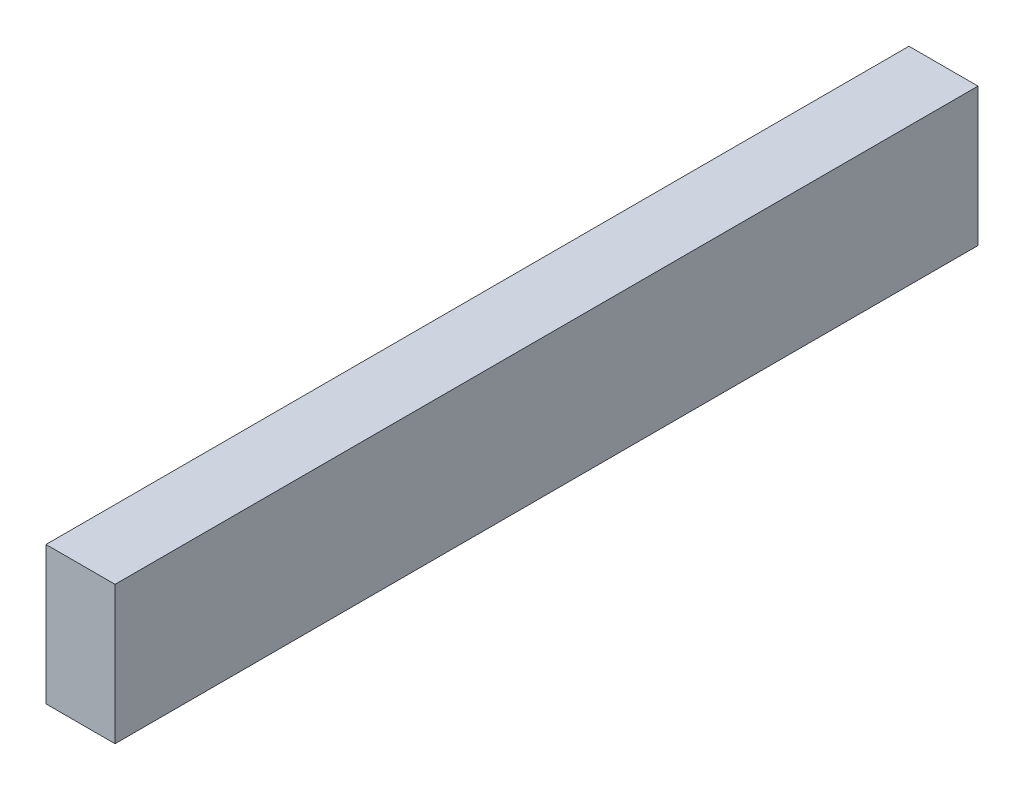
ISO-10303-21;
HEADER;
FILE_DESCRIPTION(('STEP AP214'),'2;1');
FILE_NAME('part.step','',(''),(''),'','','');
FILE_SCHEMA(('AUTOMOTIVE_DESIGN { 1 0 10303 214 1 1 1 1 }'));
ENDSEC;
DATA;
#1=APPLICATION_CONTEXT('core data for automotive mechanical design processes');
#2=APPLICATION_PROTOCOL_DEFINITION('international standard','automotive_design',2000,#1);
#3=PRODUCT_CONTEXT('',#1,'mechanical');
#4=PRODUCT('Part','Part','',(#3));
#5=PRODUCT_RELATED_PRODUCT_CATEGORY('part','',(#4));
#6=PRODUCT_DEFINITION_FORMATION('','',#4);
#7=PRODUCT_DEFINITION_CONTEXT('part definition',#1,'design');
#8=PRODUCT_DEFINITION('design','',#6,#7);
#9=PRODUCT_DEFINITION_SHAPE('','',#8);
#10=(LENGTH_UNIT() NAMED_UNIT(*) SI_UNIT(.MILLI.,.METRE.));
#11=(NAMED_UNIT(*) PLANE_ANGLE_UNIT() SI_UNIT($,.RADIAN.));
#12=(NAMED_UNIT(*) SI_UNIT($,.STERADIAN.) SOLID_ANGLE_UNIT());
#13=UNCERTAINTY_MEASURE_WITH_UNIT(LENGTH_MEASURE(1.E-05),#10,'distance_accuracy_value','');
#14=(GEOMETRIC_REPRESENTATION_CONTEXT(3) GLOBAL_UNCERTAINTY_ASSIGNED_CONTEXT((#13)) GLOBAL_UNIT_ASSIGNED_CONTEXT((#10,
#11,#12)) REPRESENTATION_CONTEXT('',''));
#15=CARTESIAN_POINT('',(0.,0.,0.));
#16=DIRECTION('',(0.,0.,1.));
#17=DIRECTION('',(1.,0.,0.));
#18=AXIS2_PLACEMENT_3D('',#15,#16,#17);
#19=CARTESIAN_POINT('',(152.,-32.3,692.64406037513));
#20=DIRECTION('',(0.,0.,-1.));
#21=DIRECTION('',(-1.,0.,0.));
#22=AXIS2_PLACEMENT_3D('',#19,#20,#21);
#23=PLANE('',#22);
#24=DIRECTION('',(0.,-1.,0.));
#25=VECTOR('',#24,1.);
#26=CARTESIAN_POINT('',(0.,-32.3,692.64406037513));
#27=LINE('',#26,#25);
#28=CARTESIAN_POINT('',(0.,271.7,692.64406037513));
#29=VERTEX_POINT('',#28);
#30=CARTESIAN_POINT('',(0.,-32.3,692.64406037513));
#31=VERTEX_POINT('',#30);
#32=EDGE_CURVE('E106',#29,#31,#27,.T.);
#33=ORIENTED_EDGE('',*,*,#32,.T.);
#34=DIRECTION('',(-1.,0.,0.));
#35=VECTOR('',#34,1.);
#36=CARTESIAN_POINT('',(152.,-32.3,692.64406037513));
#37=LINE('',#36,#35);
#38=CARTESIAN_POINT('',(152.,-32.3,692.64406037513));
#39=VERTEX_POINT('',#38);
#40=EDGE_CURVE('E12',#39,#31,#37,.T.);
#41=ORIENTED_EDGE('',*,*,#40,.F.);
#42=DIRECTION('',(0.,-1.,0.));
#43=VECTOR('',#42,1.);
#44=CARTESIAN_POINT('',(152.,-32.3,692.64406037513));
#45=LINE('',#44,#43);
#46=CARTESIAN_POINT('',(152.,271.7,692.64406037513));
#47=VERTEX_POINT('',#46);
#48=EDGE_CURVE('E94',#47,#39,#45,.T.);
#49=ORIENTED_EDGE('',*,*,#48,.F.);
#50=DIRECTION('',(-1.,0.,0.));
#51=VECTOR('',#50,1.);
#52=CARTESIAN_POINT('',(152.,271.7,692.64406037513));
#53=LINE('',#52,#51);
#54=EDGE_CURVE('E102',#47,#29,#53,.T.);
#55=ORIENTED_EDGE('',*,*,#54,.T.);
#56=EDGE_LOOP('',(#33,#41,#49,#55));
#57=FACE_BOUND('',#56,.T.);
#58=ADVANCED_FACE('F43',(#57),#23,.F.);
#59=CARTESIAN_POINT('',(152.,-32.3,692.64406037513));
#60=DIRECTION('',(0.,1.,0.));
#61=DIRECTION('',(0.,0.,1.));
#62=AXIS2_PLACEMENT_3D('',#59,#60,#61);
#63=PLANE('',#62);
#64=DIRECTION('',(0.,0.,-1.));
#65=VECTOR('',#64,1.);
#66=CARTESIAN_POINT('',(0.,-32.3,692.64406037513));
#67=LINE('',#66,#65);
#68=CARTESIAN_POINT('',(0.,-32.3,-1207.35593962487));
#69=VERTEX_POINT('',#68);
#70=EDGE_CURVE('E98',#31,#69,#67,.T.);
#71=ORIENTED_EDGE('',*,*,#70,.T.);
#72=DIRECTION('',(-1.,0.,0.));
#73=VECTOR('',#72,1.);
#74=CARTESIAN_POINT('',(152.,-32.3,-1207.35593962487));
#75=LINE('',#74,#73);
#76=CARTESIAN_POINT('',(152.,-32.3,-1207.35593962487));
#77=VERTEX_POINT('',#76);
#78=EDGE_CURVE('E51',#77,#69,#75,.T.);
#79=ORIENTED_EDGE('',*,*,#78,.F.);
#80=DIRECTION('',(0.,0.,-1.));
#81=VECTOR('',#80,1.);
#82=CARTESIAN_POINT('',(152.,-32.3,692.64406037513));
#83=LINE('',#82,#81);
#84=EDGE_CURVE('E89',#39,#77,#83,.T.);
#85=ORIENTED_EDGE('',*,*,#84,.F.);
#86=ORIENTED_EDGE('',*,*,#40,.T.);
#87=EDGE_LOOP('',(#71,#79,#85,#86));
#88=FACE_BOUND('',#87,.T.);
#89=ADVANCED_FACE('F97',(#88),#63,.F.);
#90=CARTESIAN_POINT('',(152.,-32.3,-1207.35593962487));
#91=DIRECTION('',(0.,0.,1.));
#92=DIRECTION('',(1.,0.,0.));
#93=AXIS2_PLACEMENT_3D('',#90,#91,#92);
#94=PLANE('',#93);
#95=DIRECTION('',(0.,1.,0.));
#96=VECTOR('',#95,1.);
#97=CARTESIAN_POINT('',(0.,-32.3,-1207.35593962487));
#98=LINE('',#97,#96);
#99=CARTESIAN_POINT('',(0.,271.7,-1207.35593962487));
#100=VERTEX_POINT('',#99);
#101=EDGE_CURVE('E76',#69,#100,#98,.T.);
#102=ORIENTED_EDGE('',*,*,#101,.T.);
#103=DIRECTION('',(-1.,0.,0.));
#104=VECTOR('',#103,1.);
#105=CARTESIAN_POINT('',(152.,271.7,-1207.35593962487));
#106=LINE('',#105,#104);
#107=CARTESIAN_POINT('',(152.,271.7,-1207.35593962487));
#108=VERTEX_POINT('',#107);
#109=EDGE_CURVE('E99',#108,#100,#106,.T.);
#110=ORIENTED_EDGE('',*,*,#109,.F.);
#111=DIRECTION('',(0.,1.,0.));
#112=VECTOR('',#111,1.);
#113=CARTESIAN_POINT('',(152.,-32.3,-1207.35593962487));
#114=LINE('',#113,#112);
#115=EDGE_CURVE('E92',#77,#108,#114,.T.);
#116=ORIENTED_EDGE('',*,*,#115,.F.);
#117=ORIENTED_EDGE('',*,*,#78,.T.);
#118=EDGE_LOOP('',(#102,#110,#116,#117));
#119=FACE_BOUND('',#118,.T.);
#120=ADVANCED_FACE('F100',(#119),#94,.F.);
#121=CARTESIAN_POINT('',(152.,271.7,692.64406037513));
#122=DIRECTION('',(0.,-1.,0.));
#123=DIRECTION('',(0.,0.,-1.));
#124=AXIS2_PLACEMENT_3D('',#121,#122,#123);
#125=PLANE('',#124);
#126=DIRECTION('',(0.,0.,1.));
#127=VECTOR('',#126,1.);
#128=CARTESIAN_POINT('',(0.,271.7,692.64406037513));
#129=LINE('',#128,#127);
#130=EDGE_CURVE('E82',#100,#29,#129,.T.);
#131=ORIENTED_EDGE('',*,*,#130,.T.);
#132=ORIENTED_EDGE('',*,*,#54,.F.);
#133=DIRECTION('',(0.,0.,1.));
#134=VECTOR('',#133,1.);
#135=CARTESIAN_POINT('',(152.,271.7,692.64406037513));
#136=LINE('',#135,#134);
#137=EDGE_CURVE('E59',#108,#47,#136,.T.);
#138=ORIENTED_EDGE('',*,*,#137,.F.);
#139=ORIENTED_EDGE('',*,*,#109,.T.);
#140=EDGE_LOOP('',(#131,#132,#138,#139));
#141=FACE_BOUND('',#140,.T.);
#142=ADVANCED_FACE('F113',(#141),#125,.F.);
#143=CARTESIAN_POINT('',(152.,0.,0.));
#144=DIRECTION('',(-1.,0.,0.));
#145=DIRECTION('',(0.,0.,1.));
#146=AXIS2_PLACEMENT_3D('',#143,#144,#145);
#147=PLANE('',#146);
#148=ORIENTED_EDGE('',*,*,#48,.T.);
#149=ORIENTED_EDGE('',*,*,#84,.T.);
#150=ORIENTED_EDGE('',*,*,#115,.T.);
#151=ORIENTED_EDGE('',*,*,#137,.T.);
#152=EDGE_LOOP('',(#148,#149,#150,#151));
#153=FACE_BOUND('',#152,.T.);
#154=ADVANCED_FACE('F90',(#153),#147,.F.);
#155=CARTESIAN_POINT('',(0.,0.,0.));
#156=DIRECTION('',(-1.,0.,0.));
#157=DIRECTION('',(0.,0.,1.));
#158=AXIS2_PLACEMENT_3D('',#155,#156,#157);
#159=PLANE('',#158);
#160=ORIENTED_EDGE('',*,*,#32,.F.);
#161=ORIENTED_EDGE('',*,*,#130,.F.);
#162=ORIENTED_EDGE('',*,*,#101,.F.);
#163=ORIENTED_EDGE('',*,*,#70,.F.);
#164=EDGE_LOOP('',(#160,#161,#162,#163));
#165=FACE_BOUND('',#164,.T.);
#166=ADVANCED_FACE('F116',(#165),#159,.T.);
#167=CLOSED_SHELL('',(#58,#89,#120,#142,#154,#166));
#168=MANIFOLD_SOLID_BREP('B2',#167);
#169=CARTESIAN_POINT('',(69.,0.,0.));
#170=DIRECTION('',(0.,1.,0.));
#171=DIRECTION('',(0.,0.,1.));
#172=AXIS2_PLACEMENT_3D('',#169,#170,#171);
#173=PLANE('',#172);
#174=DIRECTION('',(-1.,0.,0.));
#175=VECTOR('',#174,1.);
#176=CARTESIAN_POINT('',(-48.6,0.,-92.6559396248703));
#177=LINE('',#176,#175);
#178=CARTESIAN_POINT('',(-48.6,0.,-92.6559396248703));
#179=VERTEX_POINT('',#178);
#180=CARTESIAN_POINT('',(-69.,0.,-92.6559396248703));
#181=VERTEX_POINT('',#180);
#182=EDGE_CURVE('E356',#179,#181,#177,.T.);
#183=ORIENTED_EDGE('',*,*,#182,.T.);
#184=DIRECTION('',(0.,0.,-1.));
#185=VECTOR('',#184,1.);
#186=CARTESIAN_POINT('',(-69.,0.,0.));
#187=LINE('',#186,#185);
#188=CARTESIAN_POINT('',(-69.,0.,-165.1));
#189=VERTEX_POINT('',#188);
#190=EDGE_CURVE('E340',#181,#189,#187,.T.);
#191=ORIENTED_EDGE('',*,*,#190,.T.);
#192=DIRECTION('',(-1.,0.,0.));
#193=VECTOR('',#192,1.);
#194=CARTESIAN_POINT('',(69.,0.,-165.1));
#195=LINE('',#194,#193);
#196=CARTESIAN_POINT('',(69.,0.,-165.1));
#197=VERTEX_POINT('',#196);
#198=EDGE_CURVE('E491',#197,#189,#195,.T.);
#199=ORIENTED_EDGE('',*,*,#198,.F.);
#200=DIRECTION('',(0.,0.,-1.));
#201=VECTOR('',#200,1.);
#202=CARTESIAN_POINT('',(69.,0.,262.79362659682));
#203=LINE('',#202,#201);
#204=CARTESIAN_POINT('',(69.,0.,-92.6559396248703));
#205=VERTEX_POINT('',#204);
#206=EDGE_CURVE('E440',#205,#197,#203,.T.);
#207=ORIENTED_EDGE('',*,*,#206,.F.);
#208=DIRECTION('',(1.,0.,0.));
#209=VECTOR('',#208,1.);
#210=CARTESIAN_POINT('',(48.6,0.,-92.6559396248703));
#211=LINE('',#210,#209);
#212=CARTESIAN_POINT('',(48.6,0.,-92.6559396248703));
#213=VERTEX_POINT('',#212);
#214=EDGE_CURVE('E393',#213,#205,#211,.T.);
#215=ORIENTED_EDGE('',*,*,#214,.F.);
#216=DIRECTION('',(0.,0.,1.));
#217=VECTOR('',#216,1.);
#218=CARTESIAN_POINT('',(48.6,0.,-28.0559396248703));
#219=LINE('',#218,#217);
#220=CARTESIAN_POINT('',(48.6,0.,-28.0559396248703));
#221=VERTEX_POINT('',#220);
#222=EDGE_CURVE('E390',#213,#221,#219,.T.);
#223=ORIENTED_EDGE('',*,*,#222,.T.);
#224=DIRECTION('',(1.,0.,0.));
#225=VECTOR('',#224,1.);
#226=CARTESIAN_POINT('',(48.6,0.,-28.0559396248703));
#227=LINE('',#226,#225);
#228=CARTESIAN_POINT('',(69.,0.,-28.0559396248703));
#229=VERTEX_POINT('',#228);
#230=EDGE_CURVE('E395',#221,#229,#227,.T.);
#231=ORIENTED_EDGE('',*,*,#230,.T.);
#232=CARTESIAN_POINT('',(69.,0.,160.34406037513));
#233=VERTEX_POINT('',#232);
#234=EDGE_CURVE('E446',#233,#229,#203,.T.);
#235=ORIENTED_EDGE('',*,*,#234,.F.);
#236=DIRECTION('',(1.,0.,0.));
#237=VECTOR('',#236,1.);
#238=CARTESIAN_POINT('',(48.6,0.,160.34406037513));
#239=LINE('',#238,#237);
#240=CARTESIAN_POINT('',(48.6,0.,160.34406037513));
#241=VERTEX_POINT('',#240);
#242=EDGE_CURVE('E406',#241,#233,#239,.T.);
#243=ORIENTED_EDGE('',*,*,#242,.F.);
#244=DIRECTION('',(0.,0.,1.));
#245=VECTOR('',#244,1.);
#246=CARTESIAN_POINT('',(48.6,0.,224.94406037513));
#247=LINE('',#246,#245);
#248=CARTESIAN_POINT('',(48.6,0.,224.94406037513));
#249=VERTEX_POINT('',#248);
#250=EDGE_CURVE('E403',#241,#249,#247,.T.);
#251=ORIENTED_EDGE('',*,*,#250,.T.);
#252=DIRECTION('',(1.,0.,0.));
#253=VECTOR('',#252,1.);
#254=CARTESIAN_POINT('',(48.6,0.,224.94406037513));
#255=LINE('',#254,#253);
#256=CARTESIAN_POINT('',(69.,0.,224.94406037513));
#257=VERTEX_POINT('',#256);
#258=EDGE_CURVE('E408',#249,#257,#255,.T.);
#259=ORIENTED_EDGE('',*,*,#258,.T.);
#260=CARTESIAN_POINT('',(69.,0.,262.79362659682));
#261=VERTEX_POINT('',#260);
#262=EDGE_CURVE('E442',#261,#257,#203,.T.);
#263=ORIENTED_EDGE('',*,*,#262,.F.);
#264=DIRECTION('',(-1.,0.,0.));
#265=VECTOR('',#264,1.);
#266=CARTESIAN_POINT('',(69.,0.,262.79362659682));
#267=LINE('',#266,#265);
#268=CARTESIAN_POINT('',(-69.,0.,262.79362659682));
#269=VERTEX_POINT('',#268);
#270=EDGE_CURVE('E493',#261,#269,#267,.T.);
#271=ORIENTED_EDGE('',*,*,#270,.T.);
#272=CARTESIAN_POINT('',(-69.,0.,224.94406037513));
#273=VERTEX_POINT('',#272);
#274=EDGE_CURVE('E354',#269,#273,#187,.T.);
#275=ORIENTED_EDGE('',*,*,#274,.T.);
#276=DIRECTION('',(-1.,0.,0.));
#277=VECTOR('',#276,1.);
#278=CARTESIAN_POINT('',(-48.6,0.,224.94406037513));
#279=LINE('',#278,#277);
#280=CARTESIAN_POINT('',(-48.6,0.,224.94406037513));
#281=VERTEX_POINT('',#280);
#282=EDGE_CURVE('E379',#281,#273,#279,.T.);
#283=ORIENTED_EDGE('',*,*,#282,.F.);
#284=DIRECTION('',(0.,0.,1.));
#285=VECTOR('',#284,1.);
#286=CARTESIAN_POINT('',(-48.6,0.,224.94406037513));
#287=LINE('',#286,#285);
#288=CARTESIAN_POINT('',(-48.6,0.,160.34406037513));
#289=VERTEX_POINT('',#288);
#290=EDGE_CURVE('E376',#289,#281,#287,.T.);
#291=ORIENTED_EDGE('',*,*,#290,.F.);
#292=DIRECTION('',(-1.,0.,0.));
#293=VECTOR('',#292,1.);
#294=CARTESIAN_POINT('',(-48.6,0.,160.34406037513));
#295=LINE('',#294,#293);
#296=CARTESIAN_POINT('',(-69.,0.,160.34406037513));
#297=VERTEX_POINT('',#296);
#298=EDGE_CURVE('E382',#289,#297,#295,.T.);
#299=ORIENTED_EDGE('',*,*,#298,.T.);
#300=CARTESIAN_POINT('',(-69.,0.,-28.0559396248702));
#301=VERTEX_POINT('',#300);
#302=EDGE_CURVE('E351',#297,#301,#187,.T.);
#303=ORIENTED_EDGE('',*,*,#302,.T.);
#304=DIRECTION('',(-1.,0.,0.));
#305=VECTOR('',#304,1.);
#306=CARTESIAN_POINT('',(-48.6,0.,-28.0559396248703));
#307=LINE('',#306,#305);
#308=CARTESIAN_POINT('',(-48.6,0.,-28.0559396248703));
#309=VERTEX_POINT('',#308);
#310=EDGE_CURVE('E363',#309,#301,#307,.T.);
#311=ORIENTED_EDGE('',*,*,#310,.F.);
#312=DIRECTION('',(0.,0.,1.));
#313=VECTOR('',#312,1.);
#314=CARTESIAN_POINT('',(-48.6,0.,-28.0559396248703));
#315=LINE('',#314,#313);
#316=EDGE_CURVE('E358',#179,#309,#315,.T.);
#317=ORIENTED_EDGE('',*,*,#316,.F.);
#318=EDGE_LOOP('',(#183,#191,#199,#207,#215,#223,#231,#235,#243,#251,#259,#263,#271,#275,#283,
#291,#299,#303,#311,#317));
#319=FACE_BOUND('',#318,.T.);
#320=ADVANCED_FACE('F167',(#319),#173,.F.);
#321=CARTESIAN_POINT('',(69.,81.9,-150.1));
#322=DIRECTION('',(0.,0.,-1.));
#323=DIRECTION('',(-1.,0.,0.));
#324=AXIS2_PLACEMENT_3D('',#321,#322,#323);
#325=PLANE('',#324);
#326=DIRECTION('',(-1.,0.,0.));
#327=VECTOR('',#326,1.);
#328=CARTESIAN_POINT('',(69.,81.9,-150.1));
#329=LINE('',#328,#327);
#330=CARTESIAN_POINT('',(54.,81.9,-150.1));
#331=VERTEX_POINT('',#330);
#332=CARTESIAN_POINT('',(-54.,81.9,-150.1));
#333=VERTEX_POINT('',#332);
#334=EDGE_CURVE('E486',#331,#333,#329,.T.);
#335=ORIENTED_EDGE('',*,*,#334,.T.);
#336=DIRECTION('',(0.,-1.,0.));
#337=VECTOR('',#336,1.);
#338=CARTESIAN_POINT('',(-54.,232.747638364013,-150.1));
#339=LINE('',#338,#337);
#340=CARTESIAN_POINT('',(-54.,20.,-150.1));
#341=VERTEX_POINT('',#340);
#342=EDGE_CURVE('E423',#333,#341,#339,.T.);
#343=ORIENTED_EDGE('',*,*,#342,.T.);
#344=DIRECTION('',(-1.,0.,0.));
#345=VECTOR('',#344,1.);
#346=CARTESIAN_POINT('',(69.,20.,-150.1));
#347=LINE('',#346,#345);
#348=CARTESIAN_POINT('',(54.,20.,-150.1));
#349=VERTEX_POINT('',#348);
#350=EDGE_CURVE('E483',#349,#341,#347,.T.);
#351=ORIENTED_EDGE('',*,*,#350,.F.);
#352=DIRECTION('',(0.,-1.,0.));
#353=VECTOR('',#352,1.);
#354=CARTESIAN_POINT('',(54.,232.747638364013,-150.1));
#355=LINE('',#354,#353);
#356=EDGE_CURVE('E434',#331,#349,#355,.T.);
#357=ORIENTED_EDGE('',*,*,#356,.F.);
#358=EDGE_LOOP('',(#335,#343,#351,#357));
#359=FACE_BOUND('',#358,.T.);
#360=ADVANCED_FACE('F608',(#359),#325,.F.);
#361=CARTESIAN_POINT('',(69.,20.,-150.1));
#362=DIRECTION('',(0.,-1.,0.));
#363=DIRECTION('',(0.,0.,-1.));
#364=AXIS2_PLACEMENT_3D('',#361,#362,#363);
#365=PLANE('',#364);
#366=ORIENTED_EDGE('',*,*,#350,.T.);
#367=DIRECTION('',(0.,0.,1.));
#368=VECTOR('',#367,1.);
#369=CARTESIAN_POINT('',(-54.,20.,0.));
#370=LINE('',#369,#368);
#371=CARTESIAN_POINT('',(-54.,20.,0.));
#372=VERTEX_POINT('',#371);
#373=EDGE_CURVE('E411',#341,#372,#370,.T.);
#374=ORIENTED_EDGE('',*,*,#373,.T.);
#375=DIRECTION('',(-1.,0.,0.));
#376=VECTOR('',#375,1.);
#377=CARTESIAN_POINT('',(69.,20.,0.));
#378=LINE('',#377,#376);
#379=CARTESIAN_POINT('',(54.,20.,0.));
#380=VERTEX_POINT('',#379);
#381=EDGE_CURVE('E463',#380,#372,#378,.T.);
#382=ORIENTED_EDGE('',*,*,#381,.F.);
#383=DIRECTION('',(0.,0.,1.));
#384=VECTOR('',#383,1.);
#385=CARTESIAN_POINT('',(54.,20.,0.));
#386=LINE('',#385,#384);
#387=EDGE_CURVE('E421',#349,#380,#386,.T.);
#388=ORIENTED_EDGE('',*,*,#387,.F.);
#389=EDGE_LOOP('',(#366,#374,#382,#388));
#390=FACE_BOUND('',#389,.T.);
#391=ADVANCED_FACE('F613',(#390),#365,.F.);
#392=CARTESIAN_POINT('',(69.,20.,0.));
#393=DIRECTION('',(0.,0.,1.));
#394=DIRECTION('',(1.,0.,0.));
#395=AXIS2_PLACEMENT_3D('',#392,#393,#394);
#396=PLANE('',#395);
#397=DIRECTION('',(0.,1.,0.));
#398=VECTOR('',#397,1.);
#399=CARTESIAN_POINT('',(-69.,20.,0.));
#400=LINE('',#399,#398);
#401=CARTESIAN_POINT('',(-69.,81.8999999999999,0.));
#402=VERTEX_POINT('',#401);
#403=CARTESIAN_POINT('',(-69.,123.7,0.));
#404=VERTEX_POINT('',#403);
#405=EDGE_CURVE('E468',#402,#404,#400,.T.);
#406=ORIENTED_EDGE('',*,*,#405,.T.);
#407=DIRECTION('',(-1.,0.,0.));
#408=VECTOR('',#407,1.);
#409=CARTESIAN_POINT('',(69.,123.7,0.));
#410=LINE('',#409,#408);
#411=CARTESIAN_POINT('',(69.,123.7,0.));
#412=VERTEX_POINT('',#411);
#413=EDGE_CURVE('E515',#404,#412,#410,.F.);
#414=ORIENTED_EDGE('',*,*,#413,.T.);
#415=DIRECTION('',(0.,1.,0.));
#416=VECTOR('',#415,1.);
#417=CARTESIAN_POINT('',(69.,20.,0.));
#418=LINE('',#417,#416);
#419=CARTESIAN_POINT('',(69.,81.8999999999998,0.));
#420=VERTEX_POINT('',#419);
#421=EDGE_CURVE('E450',#420,#412,#418,.T.);
#422=ORIENTED_EDGE('',*,*,#421,.F.);
#423=DIRECTION('',(-1.,0.,0.));
#424=VECTOR('',#423,1.);
#425=CARTESIAN_POINT('',(69.,81.8999999999998,0.));
#426=LINE('',#425,#424);
#427=CARTESIAN_POINT('',(54.,81.8999999999999,0.));
#428=VERTEX_POINT('',#427);
#429=EDGE_CURVE('E429',#420,#428,#426,.T.);
#430=ORIENTED_EDGE('',*,*,#429,.T.);
#431=DIRECTION('',(0.,-1.,0.));
#432=VECTOR('',#431,1.);
#433=CARTESIAN_POINT('',(54.,232.747638364013,0.));
#434=LINE('',#433,#432);
#435=EDGE_CURVE('E431',#428,#380,#434,.T.);
#436=ORIENTED_EDGE('',*,*,#435,.T.);
#437=ORIENTED_EDGE('',*,*,#381,.T.);
#438=DIRECTION('',(0.,-1.,0.));
#439=VECTOR('',#438,1.);
#440=CARTESIAN_POINT('',(-54.,232.747638364013,0.));
#441=LINE('',#440,#439);
#442=CARTESIAN_POINT('',(-54.,81.8999999999998,0.));
#443=VERTEX_POINT('',#442);
#444=EDGE_CURVE('E418',#443,#372,#441,.T.);
#445=ORIENTED_EDGE('',*,*,#444,.F.);
#446=DIRECTION('',(1.,0.,0.));
#447=VECTOR('',#446,1.);
#448=CARTESIAN_POINT('',(-69.,81.8999999999998,0.));
#449=LINE('',#448,#447);
#450=EDGE_CURVE('E417',#402,#443,#449,.T.);
#451=ORIENTED_EDGE('',*,*,#450,.F.);
#452=EDGE_LOOP('',(#406,#414,#422,#430,#436,#437,#445,#451));
#453=FACE_BOUND('',#452,.T.);
#454=ADVANCED_FACE('F621',(#453),#396,.F.);
#455=CARTESIAN_POINT('',(69.,15.7395723137565,255.14406037513));
#456=DIRECTION('',(-1.,0.,0.));
#457=DIRECTION('',(0.,0.,1.));
#458=AXIS2_PLACEMENT_3D('',#455,#456,#457);
#459=CYLINDRICAL_SURFACE('',#458,17.5);
#460=CARTESIAN_POINT('',(69.,15.7395723137565,255.14406037513));
#461=DIRECTION('',(1.,0.,0.));
#462=DIRECTION('',(0.,0.,-1.));
#463=AXIS2_PLACEMENT_3D('',#460,#461,#462);
#464=CIRCLE('',#463,17.5);
#465=CARTESIAN_POINT('',(69.,29.1597981364929,266.375602516206));
#466=VERTEX_POINT('',#465);
#467=EDGE_CURVE('E438',#466,#261,#464,.T.);
#468=ORIENTED_EDGE('',*,*,#467,.F.);
#469=DIRECTION('',(-1.,0.,0.));
#470=VECTOR('',#469,1.);
#471=CARTESIAN_POINT('',(69.,29.1597981364929,266.375602516206));
#472=LINE('',#471,#470);
#473=CARTESIAN_POINT('',(-69.,29.1597981364929,266.375602516206));
#474=VERTEX_POINT('',#473);
#475=EDGE_CURVE('E496',#466,#474,#472,.T.);
#476=ORIENTED_EDGE('',*,*,#475,.T.);
#477=CARTESIAN_POINT('',(-69.,15.7395723137565,255.14406037513));
#478=DIRECTION('',(1.,0.,0.));
#479=DIRECTION('',(0.,0.,-1.));
#480=AXIS2_PLACEMENT_3D('',#477,#478,#479);
#481=CIRCLE('',#480,17.5);
#482=EDGE_CURVE('E352',#474,#269,#481,.T.);
#483=ORIENTED_EDGE('',*,*,#482,.T.);
#484=ORIENTED_EDGE('',*,*,#270,.F.);
#485=EDGE_LOOP('',(#468,#476,#483,#484));
#486=FACE_BOUND('',#485,.T.);
#487=ADVANCED_FACE('F563',(#486),#459,.T.);
#488=CARTESIAN_POINT('',(69.,0.,-165.1));
#489=DIRECTION('',(0.,0.,1.));
#490=DIRECTION('',(1.,0.,0.));
#491=AXIS2_PLACEMENT_3D('',#488,#489,#490);
#492=PLANE('',#491);
#493=DIRECTION('',(0.,1.,0.));
#494=VECTOR('',#493,1.);
#495=CARTESIAN_POINT('',(-69.,0.,-165.1));
#496=LINE('',#495,#494);
#497=CARTESIAN_POINT('',(-69.,81.9,-165.1));
#498=VERTEX_POINT('',#497);
#499=EDGE_CURVE('E347',#189,#498,#496,.T.);
#500=ORIENTED_EDGE('',*,*,#499,.T.);
#501=DIRECTION('',(-1.,0.,0.));
#502=VECTOR('',#501,1.);
#503=CARTESIAN_POINT('',(69.,81.9,-165.1));
#504=LINE('',#503,#502);
#505=CARTESIAN_POINT('',(69.,81.9,-165.1));
#506=VERTEX_POINT('',#505);
#507=EDGE_CURVE('E488',#506,#498,#504,.T.);
#508=ORIENTED_EDGE('',*,*,#507,.F.);
#509=DIRECTION('',(0.,1.,0.));
#510=VECTOR('',#509,1.);
#511=CARTESIAN_POINT('',(69.,0.,-165.1));
#512=LINE('',#511,#510);
#513=EDGE_CURVE('E445',#197,#506,#512,.T.);
#514=ORIENTED_EDGE('',*,*,#513,.F.);
#515=ORIENTED_EDGE('',*,*,#198,.T.);
#516=EDGE_LOOP('',(#500,#508,#514,#515));
#517=FACE_BOUND('',#516,.T.);
#518=ADVANCED_FACE('F580',(#517),#492,.F.);
#519=CARTESIAN_POINT('',(69.,81.9,-165.1));
#520=DIRECTION('',(0.,-1.,0.));
#521=DIRECTION('',(0.,0.,-1.));
#522=AXIS2_PLACEMENT_3D('',#519,#520,#521);
#523=PLANE('',#522);
#524=DIRECTION('',(0.,0.,1.));
#525=VECTOR('',#524,1.);
#526=CARTESIAN_POINT('',(-69.,81.9,-165.1));
#527=LINE('',#526,#525);
#528=EDGE_CURVE('E466',#498,#402,#527,.T.);
#529=ORIENTED_EDGE('',*,*,#528,.T.);
#530=ORIENTED_EDGE('',*,*,#450,.T.);
#531=DIRECTION('',(0.,0.,-1.));
#532=VECTOR('',#531,1.);
#533=CARTESIAN_POINT('',(-54.,81.8999999999998,-1.1346331053111E-13));
#534=LINE('',#533,#532);
#535=EDGE_CURVE('E414',#443,#333,#534,.T.);
#536=ORIENTED_EDGE('',*,*,#535,.T.);
#537=ORIENTED_EDGE('',*,*,#334,.F.);
#538=DIRECTION('',(0.,0.,-1.));
#539=VECTOR('',#538,1.);
#540=CARTESIAN_POINT('',(54.,81.8999999999998,-1.1346331053111E-13));
#541=LINE('',#540,#539);
#542=EDGE_CURVE('E427',#428,#331,#541,.T.);
#543=ORIENTED_EDGE('',*,*,#542,.F.);
#544=ORIENTED_EDGE('',*,*,#429,.F.);
#545=DIRECTION('',(0.,0.,1.));
#546=VECTOR('',#545,1.);
#547=CARTESIAN_POINT('',(69.,81.9,-165.1));
#548=LINE('',#547,#546);
#549=EDGE_CURVE('E448',#506,#420,#548,.T.);
#550=ORIENTED_EDGE('',*,*,#549,.F.);
#551=ORIENTED_EDGE('',*,*,#507,.T.);
#552=EDGE_LOOP('',(#529,#530,#536,#537,#543,#544,#550,#551));
#553=FACE_BOUND('',#552,.T.);
#554=ADVANCED_FACE('F584',(#553),#523,.F.);
#555=CARTESIAN_POINT('',(69.,133.7,0.));
#556=DIRECTION('',(0.,-1.,0.));
#557=DIRECTION('',(0.,0.,-1.));
#558=AXIS2_PLACEMENT_3D('',#555,#556,#557);
#559=PLANE('',#558);
#560=DIRECTION('',(0.,0.,1.));
#561=VECTOR('',#560,1.);
#562=CARTESIAN_POINT('',(69.,133.7,0.));
#563=LINE('',#562,#561);
#564=CARTESIAN_POINT('',(69.,133.7,10.));
#565=VERTEX_POINT('',#564);
#566=CARTESIAN_POINT('',(69.,133.7,111.84701211121));
#567=VERTEX_POINT('',#566);
#568=EDGE_CURVE('E453',#565,#567,#563,.T.);
#569=ORIENTED_EDGE('',*,*,#568,.F.);
#570=DIRECTION('',(-1.,0.,0.));
#571=VECTOR('',#570,1.);
#572=CARTESIAN_POINT('',(69.,133.7,10.));
#573=LINE('',#572,#571);
#574=CARTESIAN_POINT('',(-69.,133.7,10.));
#575=VERTEX_POINT('',#574);
#576=EDGE_CURVE('E506',#565,#575,#573,.T.);
#577=ORIENTED_EDGE('',*,*,#576,.T.);
#578=DIRECTION('',(0.,0.,1.));
#579=VECTOR('',#578,1.);
#580=CARTESIAN_POINT('',(-69.,133.7,0.));
#581=LINE('',#580,#579);
#582=CARTESIAN_POINT('',(-69.,133.7,111.84701211121));
#583=VERTEX_POINT('',#582);
#584=EDGE_CURVE('E471',#575,#583,#581,.T.);
#585=ORIENTED_EDGE('',*,*,#584,.T.);
#586=DIRECTION('',(-1.,0.,0.));
#587=VECTOR('',#586,1.);
#588=CARTESIAN_POINT('',(69.,133.7,111.84701211121));
#589=LINE('',#588,#587);
#590=EDGE_CURVE('E504',#583,#567,#589,.F.);
#591=ORIENTED_EDGE('',*,*,#590,.T.);
#592=EDGE_LOOP('',(#569,#577,#585,#591));
#593=FACE_BOUND('',#592,.T.);
#594=ADVANCED_FACE('F594',(#593),#559,.F.);
#595=CARTESIAN_POINT('',(69.,133.7,115.));
#596=DIRECTION('',(0.,-0.819152044288995,-0.573576436351042));
#597=DIRECTION('',(0.,0.573576436351042,-0.819152044288995));
#598=AXIS2_PLACEMENT_3D('',#595,#596,#597);
#599=PLANE('',#598);
#600=DIRECTION('',(0.,-0.573576436351042,0.819152044288994));
#601=VECTOR('',#600,1.);
#602=CARTESIAN_POINT('',(69.,133.7,115.));
#603=LINE('',#602,#601);
#604=CARTESIAN_POINT('',(69.,131.89152044289,117.582776474721));
#605=VERTEX_POINT('',#604);
#606=CARTESIAN_POINT('',(69.,95.7296916570861,169.227220175317));
#607=VERTEX_POINT('',#606);
#608=EDGE_CURVE('E456',#605,#607,#603,.T.);
#609=ORIENTED_EDGE('',*,*,#608,.F.);
#610=DIRECTION('',(-1.,0.,0.));
#611=VECTOR('',#610,1.);
#612=CARTESIAN_POINT('',(69.,131.89152044289,117.582776474721));
#613=LINE('',#612,#611);
#614=CARTESIAN_POINT('',(-69.,131.89152044289,117.582776474721));
#615=VERTEX_POINT('',#614);
#616=EDGE_CURVE('E525',#605,#615,#613,.T.);
#617=ORIENTED_EDGE('',*,*,#616,.T.);
#618=DIRECTION('',(0.,-0.573576436351042,0.819152044288994));
#619=VECTOR('',#618,1.);
#620=CARTESIAN_POINT('',(-69.,133.7,115.));
#621=LINE('',#620,#619);
#622=CARTESIAN_POINT('',(-69.,95.7296916570861,169.227220175317));
#623=VERTEX_POINT('',#622);
#624=EDGE_CURVE('E474',#615,#623,#621,.T.);
#625=ORIENTED_EDGE('',*,*,#624,.T.);
#626=DIRECTION('',(-1.,0.,0.));
#627=VECTOR('',#626,1.);
#628=CARTESIAN_POINT('',(69.,95.7296916570861,169.227220175317));
#629=LINE('',#628,#627);
#630=EDGE_CURVE('E523',#623,#607,#629,.F.);
#631=ORIENTED_EDGE('',*,*,#630,.T.);
#632=EDGE_LOOP('',(#609,#617,#625,#631));
#633=FACE_BOUND('',#632,.T.);
#634=ADVANCED_FACE('F542',(#633),#599,.F.);
#635=CARTESIAN_POINT('',(69.,94.3526564663185,171.193830238225));
#636=DIRECTION('',(0.,-0.990268068741571,-0.139173100960059));
#637=DIRECTION('',(0.,0.139173100960059,-0.990268068741571));
#638=AXIS2_PLACEMENT_3D('',#635,#636,#637);
#639=PLANE('',#638);
#640=DIRECTION('',(0.,-0.139173100960059,0.990268068741571));
#641=VECTOR('',#640,1.);
#642=CARTESIAN_POINT('',(69.,94.3526564663185,171.193830238225));
#643=LINE('',#642,#641);
#644=CARTESIAN_POINT('',(69.,94.0185314125603,173.571253529226));
#645=VERTEX_POINT('',#644);
#646=CARTESIAN_POINT('',(69.,82.6889579367665,254.185357606421));
#647=VERTEX_POINT('',#646);
#648=EDGE_CURVE('E458',#645,#647,#643,.T.);
#649=ORIENTED_EDGE('',*,*,#648,.F.);
#650=DIRECTION('',(-1.,0.,0.));
#651=VECTOR('',#650,1.);
#652=CARTESIAN_POINT('',(-69.,94.0185314125603,173.571253529226));
#653=LINE('',#652,#651);
#654=CARTESIAN_POINT('',(-69.,94.0185314125603,173.571253529226));
#655=VERTEX_POINT('',#654);
#656=EDGE_CURVE('E529',#645,#655,#653,.T.);
#657=ORIENTED_EDGE('',*,*,#656,.T.);
#658=DIRECTION('',(0.,-0.139173100960059,0.990268068741571));
#659=VECTOR('',#658,1.);
#660=CARTESIAN_POINT('',(-69.,94.3526564663185,171.193830238225));
#661=LINE('',#660,#659);
#662=CARTESIAN_POINT('',(-69.,82.6889579367665,254.185357606421));
#663=VERTEX_POINT('',#662);
#664=EDGE_CURVE('E477',#655,#663,#661,.T.);
#665=ORIENTED_EDGE('',*,*,#664,.T.);
#666=DIRECTION('',(-1.,0.,0.));
#667=VECTOR('',#666,1.);
#668=CARTESIAN_POINT('',(69.,82.6889579367665,254.185357606421));
#669=LINE('',#668,#667);
#670=EDGE_CURVE('E182',#663,#647,#669,.F.);
#671=ORIENTED_EDGE('',*,*,#670,.T.);
#672=EDGE_LOOP('',(#649,#657,#665,#671));
#673=FACE_BOUND('',#672,.T.);
#674=ADVANCED_FACE('F545',(#673),#639,.F.);
#675=CARTESIAN_POINT('',(69.,81.4791446275131,262.79362659682));
#676=DIRECTION('',(0.,0.,-1.));
#677=DIRECTION('',(0.,1.,0.));
#678=AXIS2_PLACEMENT_3D('',#675,#676,#677);
#679=PLANE('',#678);
#680=DIRECTION('',(0.,-1.,0.));
#681=VECTOR('',#680,1.);
#682=CARTESIAN_POINT('',(-69.,81.4791446275131,262.79362659682));
#683=LINE('',#682,#681);
#684=CARTESIAN_POINT('',(-69.,72.7862772493507,262.79362659682));
#685=VERTEX_POINT('',#684);
#686=CARTESIAN_POINT('',(-69.,36.8284986066279,262.79362659682));
#687=VERTEX_POINT('',#686);
#688=EDGE_CURVE('E441',#685,#687,#683,.T.);
#689=ORIENTED_EDGE('',*,*,#688,.T.);
#690=DIRECTION('',(1.,0.,0.));
#691=VECTOR('',#690,1.);
#692=CARTESIAN_POINT('',(69.,36.8284986066279,262.79362659682));
#693=LINE('',#692,#691);
#694=CARTESIAN_POINT('',(69.,36.8284986066279,262.79362659682));
#695=VERTEX_POINT('',#694);
#696=EDGE_CURVE('E502',#687,#695,#693,.T.);
#697=ORIENTED_EDGE('',*,*,#696,.T.);
#698=DIRECTION('',(0.,-1.,0.));
#699=VECTOR('',#698,1.);
#700=CARTESIAN_POINT('',(69.,81.4791446275131,262.79362659682));
#701=LINE('',#700,#699);
#702=CARTESIAN_POINT('',(69.,72.7862772493507,262.79362659682));
#703=VERTEX_POINT('',#702);
#704=EDGE_CURVE('E460',#703,#695,#701,.T.);
#705=ORIENTED_EDGE('',*,*,#704,.F.);
#706=DIRECTION('',(-1.,0.,0.));
#707=VECTOR('',#706,1.);
#708=CARTESIAN_POINT('',(69.,72.7862772493507,262.79362659682));
#709=LINE('',#708,#707);
#710=EDGE_CURVE('E499',#703,#685,#709,.T.);
#711=ORIENTED_EDGE('',*,*,#710,.T.);
#712=EDGE_LOOP('',(#689,#697,#705,#711));
#713=FACE_BOUND('',#712,.T.);
#714=ADVANCED_FACE('F553',(#713),#679,.F.);
#715=CARTESIAN_POINT('',(69.,15.7395723137565,255.14406037513));
#716=DIRECTION('',(1.,0.,0.));
#717=DIRECTION('',(0.,0.,-1.));
#718=AXIS2_PLACEMENT_3D('',#715,#716,#717);
#719=PLANE('',#718);
#720=ORIENTED_EDGE('',*,*,#421,.T.);
#721=CARTESIAN_POINT('',(69.,123.7,10.));
#722=DIRECTION('',(1.,0.,0.));
#723=DIRECTION('',(0.,0.,-1.));
#724=AXIS2_PLACEMENT_3D('',#721,#722,#723);
#725=CIRCLE('',#724,10.);
#726=EDGE_CURVE('E521',#412,#565,#725,.T.);
#727=ORIENTED_EDGE('',*,*,#726,.T.);
#728=ORIENTED_EDGE('',*,*,#568,.T.);
#729=CARTESIAN_POINT('',(69.,123.7,111.84701211121));
#730=DIRECTION('',(1.,0.,0.));
#731=DIRECTION('',(0.,0.,-1.));
#732=AXIS2_PLACEMENT_3D('',#729,#730,#731);
#733=CIRCLE('',#732,10.);
#734=EDGE_CURVE('E519',#567,#605,#733,.T.);
#735=ORIENTED_EDGE('',*,*,#734,.T.);
#736=ORIENTED_EDGE('',*,*,#608,.T.);
#737=CARTESIAN_POINT('',(69.,103.921212099976,174.962984538827));
#738=DIRECTION('',(1.,0.,0.));
#739=DIRECTION('',(0.,0.,-1.));
#740=AXIS2_PLACEMENT_3D('',#737,#738,#739);
#741=CIRCLE('',#740,10.);
#742=EDGE_CURVE('E41',#607,#645,#741,.F.);
#743=ORIENTED_EDGE('',*,*,#742,.T.);
#744=ORIENTED_EDGE('',*,*,#648,.T.);
#745=CARTESIAN_POINT('',(69.,72.7862772493507,252.79362659682));
#746=DIRECTION('',(1.,0.,0.));
#747=DIRECTION('',(0.,0.,-1.));
#748=AXIS2_PLACEMENT_3D('',#745,#746,#747);
#749=CIRCLE('',#748,10.);
#750=EDGE_CURVE('E517',#647,#703,#749,.T.);
#751=ORIENTED_EDGE('',*,*,#750,.T.);
#752=ORIENTED_EDGE('',*,*,#704,.T.);
#753=CARTESIAN_POINT('',(69.,36.8284986066279,272.79362659682));
#754=DIRECTION('',(1.,0.,0.));
#755=DIRECTION('',(0.,0.,-1.));
#756=AXIS2_PLACEMENT_3D('',#753,#754,#755);
#757=CIRCLE('',#756,10.);
#758=EDGE_CURVE('E534',#695,#466,#757,.F.);
#759=ORIENTED_EDGE('',*,*,#758,.T.);
#760=ORIENTED_EDGE('',*,*,#467,.T.);
#761=ORIENTED_EDGE('',*,*,#262,.T.);
#762=CARTESIAN_POINT('',(69.,0.,192.64406037513));
#763=DIRECTION('',(1.,0.,0.));
#764=DIRECTION('',(0.,0.,-1.));
#765=AXIS2_PLACEMENT_3D('',#762,#763,#764);
#766=CIRCLE('',#765,32.3);
#767=EDGE_CURVE('E398',#257,#233,#766,.T.);
#768=ORIENTED_EDGE('',*,*,#767,.T.);
#769=ORIENTED_EDGE('',*,*,#234,.T.);
#770=CARTESIAN_POINT('',(69.,0.,-60.3559396248703));
#771=DIRECTION('',(1.,0.,0.));
#772=DIRECTION('',(0.,0.,-1.));
#773=AXIS2_PLACEMENT_3D('',#770,#771,#772);
#774=CIRCLE('',#773,32.3);
#775=EDGE_CURVE('E385',#229,#205,#774,.T.);
#776=ORIENTED_EDGE('',*,*,#775,.T.);
#777=ORIENTED_EDGE('',*,*,#206,.T.);
#778=ORIENTED_EDGE('',*,*,#513,.T.);
#779=ORIENTED_EDGE('',*,*,#549,.T.);
#780=EDGE_LOOP('',(#720,#727,#728,#735,#736,#743,#744,#751,#752,#759,#760,#761,#768,#769,#776,
#777,#778,#779));
#781=FACE_BOUND('',#780,.T.);
#782=ADVANCED_FACE('F547',(#781),#719,.T.);
#783=CARTESIAN_POINT('',(-69.,15.7395723137565,255.14406037513));
#784=DIRECTION('',(1.,0.,0.));
#785=DIRECTION('',(0.,0.,-1.));
#786=AXIS2_PLACEMENT_3D('',#783,#784,#785);
#787=PLANE('',#786);
#788=ORIENTED_EDGE('',*,*,#584,.F.);
#789=CARTESIAN_POINT('',(-69.,123.7,10.));
#790=DIRECTION('',(1.,0.,0.));
#791=DIRECTION('',(0.,0.,-1.));
#792=AXIS2_PLACEMENT_3D('',#789,#790,#791);
#793=CIRCLE('',#792,10.);
#794=EDGE_CURVE('E513',#575,#404,#793,.F.);
#795=ORIENTED_EDGE('',*,*,#794,.T.);
#796=ORIENTED_EDGE('',*,*,#405,.F.);
#797=ORIENTED_EDGE('',*,*,#528,.F.);
#798=ORIENTED_EDGE('',*,*,#499,.F.);
#799=ORIENTED_EDGE('',*,*,#190,.F.);
#800=CARTESIAN_POINT('',(-69.,0.,-60.3559396248703));
#801=DIRECTION('',(1.,0.,0.));
#802=DIRECTION('',(0.,0.,-1.));
#803=AXIS2_PLACEMENT_3D('',#800,#801,#802);
#804=CIRCLE('',#803,32.3);
#805=EDGE_CURVE('E345',#301,#181,#804,.T.);
#806=ORIENTED_EDGE('',*,*,#805,.F.);
#807=ORIENTED_EDGE('',*,*,#302,.F.);
#808=CARTESIAN_POINT('',(-69.,0.,192.64406037513));
#809=DIRECTION('',(1.,0.,0.));
#810=DIRECTION('',(0.,0.,-1.));
#811=AXIS2_PLACEMENT_3D('',#808,#809,#810);
#812=CIRCLE('',#811,32.3);
#813=EDGE_CURVE('E362',#273,#297,#812,.T.);
#814=ORIENTED_EDGE('',*,*,#813,.F.);
#815=ORIENTED_EDGE('',*,*,#274,.F.);
#816=ORIENTED_EDGE('',*,*,#482,.F.);
#817=CARTESIAN_POINT('',(-69.,36.8284986066279,272.79362659682));
#818=DIRECTION('',(1.,0.,0.));
#819=DIRECTION('',(0.,0.,-1.));
#820=AXIS2_PLACEMENT_3D('',#817,#818,#819);
#821=CIRCLE('',#820,10.);
#822=EDGE_CURVE('E532',#474,#687,#821,.T.);
#823=ORIENTED_EDGE('',*,*,#822,.T.);
#824=ORIENTED_EDGE('',*,*,#688,.F.);
#825=CARTESIAN_POINT('',(-69.,72.7862772493507,252.79362659682));
#826=DIRECTION('',(1.,0.,0.));
#827=DIRECTION('',(0.,0.,-1.));
#828=AXIS2_PLACEMENT_3D('',#825,#826,#827);
#829=CIRCLE('',#828,10.);
#830=EDGE_CURVE('E509',#685,#663,#829,.F.);
#831=ORIENTED_EDGE('',*,*,#830,.T.);
#832=ORIENTED_EDGE('',*,*,#664,.F.);
#833=CARTESIAN_POINT('',(-69.,103.921212099976,174.962984538827));
#834=DIRECTION('',(1.,0.,0.));
#835=DIRECTION('',(0.,0.,-1.));
#836=AXIS2_PLACEMENT_3D('',#833,#834,#835);
#837=CIRCLE('',#836,10.);
#838=EDGE_CURVE('E175',#655,#623,#837,.T.);
#839=ORIENTED_EDGE('',*,*,#838,.T.);
#840=ORIENTED_EDGE('',*,*,#624,.F.);
#841=CARTESIAN_POINT('',(-69.,123.7,111.84701211121));
#842=DIRECTION('',(1.,0.,0.));
#843=DIRECTION('',(0.,0.,-1.));
#844=AXIS2_PLACEMENT_3D('',#841,#842,#843);
#845=CIRCLE('',#844,10.);
#846=EDGE_CURVE('E511',#615,#583,#845,.F.);
#847=ORIENTED_EDGE('',*,*,#846,.T.);
#848=EDGE_LOOP('',(#788,#795,#796,#797,#798,#799,#806,#807,#814,#815,#816,#823,#824,#831,#832,
#839,#840,#847));
#849=FACE_BOUND('',#848,.T.);
#850=ADVANCED_FACE('F343',(#849),#787,.F.);
#851=CARTESIAN_POINT('',(54.,232.747638364013,0.));
#852=DIRECTION('',(1.,0.,0.));
#853=DIRECTION('',(0.,0.,-1.));
#854=AXIS2_PLACEMENT_3D('',#851,#852,#853);
#855=PLANE('',#854);
#856=ORIENTED_EDGE('',*,*,#435,.F.);
#857=ORIENTED_EDGE('',*,*,#542,.T.);
#858=ORIENTED_EDGE('',*,*,#356,.T.);
#859=ORIENTED_EDGE('',*,*,#387,.T.);
#860=EDGE_LOOP('',(#856,#857,#858,#859));
#861=FACE_BOUND('',#860,.T.);
#862=ADVANCED_FACE('F657',(#861),#855,.F.);
#863=CARTESIAN_POINT('',(-54.,232.747638364013,0.));
#864=DIRECTION('',(1.,0.,0.));
#865=DIRECTION('',(0.,0.,-1.));
#866=AXIS2_PLACEMENT_3D('',#863,#864,#865);
#867=PLANE('',#866);
#868=ORIENTED_EDGE('',*,*,#535,.F.);
#869=ORIENTED_EDGE('',*,*,#444,.T.);
#870=ORIENTED_EDGE('',*,*,#373,.F.);
#871=ORIENTED_EDGE('',*,*,#342,.F.);
#872=EDGE_LOOP('',(#868,#869,#870,#871));
#873=FACE_BOUND('',#872,.T.);
#874=ADVANCED_FACE('F654',(#873),#867,.T.);
#875=CARTESIAN_POINT('',(48.6,0.,192.64406037513));
#876=DIRECTION('',(1.,0.,0.));
#877=DIRECTION('',(0.,0.,-1.));
#878=AXIS2_PLACEMENT_3D('',#875,#876,#877);
#879=CYLINDRICAL_SURFACE('',#878,32.3);
#880=ORIENTED_EDGE('',*,*,#767,.F.);
#881=ORIENTED_EDGE('',*,*,#258,.F.);
#882=CARTESIAN_POINT('',(48.6,0.,192.64406037513));
#883=DIRECTION('',(1.,0.,0.));
#884=DIRECTION('',(0.,0.,-1.));
#885=AXIS2_PLACEMENT_3D('',#882,#883,#884);
#886=CIRCLE('',#885,32.3);
#887=EDGE_CURVE('E401',#249,#241,#886,.T.);
#888=ORIENTED_EDGE('',*,*,#887,.T.);
#889=ORIENTED_EDGE('',*,*,#242,.T.);
#890=EDGE_LOOP('',(#880,#881,#888,#889));
#891=FACE_BOUND('',#890,.T.);
#892=ADVANCED_FACE('F570',(#891),#879,.T.);
#893=CARTESIAN_POINT('',(48.6,0.,192.64406037513));
#894=DIRECTION('',(1.,0.,0.));
#895=DIRECTION('',(0.,0.,-1.));
#896=AXIS2_PLACEMENT_3D('',#893,#894,#895);
#897=PLANE('',#896);
#898=ORIENTED_EDGE('',*,*,#887,.F.);
#899=ORIENTED_EDGE('',*,*,#250,.F.);
#900=EDGE_LOOP('',(#898,#899));
#901=FACE_BOUND('',#900,.T.);
#902=ADVANCED_FACE('F572',(#901),#897,.F.);
#903=CARTESIAN_POINT('',(48.6,0.,-60.3559396248703));
#904=DIRECTION('',(1.,0.,0.));
#905=DIRECTION('',(0.,0.,-1.));
#906=AXIS2_PLACEMENT_3D('',#903,#904,#905);
#907=CYLINDRICAL_SURFACE('',#906,32.3);
#908=ORIENTED_EDGE('',*,*,#775,.F.);
#909=ORIENTED_EDGE('',*,*,#230,.F.);
#910=CARTESIAN_POINT('',(48.6,0.,-60.3559396248703));
#911=DIRECTION('',(1.,0.,0.));
#912=DIRECTION('',(0.,0.,-1.));
#913=AXIS2_PLACEMENT_3D('',#910,#911,#912);
#914=CIRCLE('',#913,32.3);
#915=EDGE_CURVE('E388',#221,#213,#914,.T.);
#916=ORIENTED_EDGE('',*,*,#915,.T.);
#917=ORIENTED_EDGE('',*,*,#214,.T.);
#918=EDGE_LOOP('',(#908,#909,#916,#917));
#919=FACE_BOUND('',#918,.T.);
#920=ADVANCED_FACE('F645',(#919),#907,.T.);
#921=CARTESIAN_POINT('',(48.6,0.,-60.3559396248703));
#922=DIRECTION('',(1.,0.,0.));
#923=DIRECTION('',(0.,0.,-1.));
#924=AXIS2_PLACEMENT_3D('',#921,#922,#923);
#925=PLANE('',#924);
#926=ORIENTED_EDGE('',*,*,#915,.F.);
#927=ORIENTED_EDGE('',*,*,#222,.F.);
#928=EDGE_LOOP('',(#926,#927));
#929=FACE_BOUND('',#928,.T.);
#930=ADVANCED_FACE('F641',(#929),#925,.F.);
#931=CARTESIAN_POINT('',(-48.6,0.,192.64406037513));
#932=DIRECTION('',(-1.,0.,0.));
#933=DIRECTION('',(0.,0.,1.));
#934=AXIS2_PLACEMENT_3D('',#931,#932,#933);
#935=CYLINDRICAL_SURFACE('',#934,32.3);
#936=ORIENTED_EDGE('',*,*,#813,.T.);
#937=ORIENTED_EDGE('',*,*,#298,.F.);
#938=CARTESIAN_POINT('',(-48.6,0.,192.64406037513));
#939=DIRECTION('',(1.,0.,0.));
#940=DIRECTION('',(0.,0.,-1.));
#941=AXIS2_PLACEMENT_3D('',#938,#939,#940);
#942=CIRCLE('',#941,32.3);
#943=EDGE_CURVE('E373',#281,#289,#942,.T.);
#944=ORIENTED_EDGE('',*,*,#943,.F.);
#945=ORIENTED_EDGE('',*,*,#282,.T.);
#946=EDGE_LOOP('',(#936,#937,#944,#945));
#947=FACE_BOUND('',#946,.T.);
#948=ADVANCED_FACE('F637',(#947),#935,.T.);
#949=CARTESIAN_POINT('',(-48.6,0.,192.64406037513));
#950=DIRECTION('',(-1.,0.,0.));
#951=DIRECTION('',(0.,0.,-1.));
#952=AXIS2_PLACEMENT_3D('',#949,#950,#951);
#953=PLANE('',#952);
#954=ORIENTED_EDGE('',*,*,#943,.T.);
#955=ORIENTED_EDGE('',*,*,#290,.T.);
#956=EDGE_LOOP('',(#954,#955));
#957=FACE_BOUND('',#956,.T.);
#958=ADVANCED_FACE('F632',(#957),#953,.F.);
#959=CARTESIAN_POINT('',(-48.6,0.,-60.3559396248703));
#960=DIRECTION('',(-1.,0.,0.));
#961=DIRECTION('',(0.,0.,1.));
#962=AXIS2_PLACEMENT_3D('',#959,#960,#961);
#963=CYLINDRICAL_SURFACE('',#962,32.3);
#964=ORIENTED_EDGE('',*,*,#805,.T.);
#965=ORIENTED_EDGE('',*,*,#182,.F.);
#966=CARTESIAN_POINT('',(-48.6,0.,-60.3559396248703));
#967=DIRECTION('',(1.,0.,0.));
#968=DIRECTION('',(0.,0.,-1.));
#969=AXIS2_PLACEMENT_3D('',#966,#967,#968);
#970=CIRCLE('',#969,32.3);
#971=EDGE_CURVE('E367',#309,#179,#970,.T.);
#972=ORIENTED_EDGE('',*,*,#971,.F.);
#973=ORIENTED_EDGE('',*,*,#310,.T.);
#974=EDGE_LOOP('',(#964,#965,#972,#973));
#975=FACE_BOUND('',#974,.T.);
#976=ADVANCED_FACE('F366',(#975),#963,.T.);
#977=CARTESIAN_POINT('',(-48.6,0.,-60.3559396248703));
#978=DIRECTION('',(-1.,0.,0.));
#979=DIRECTION('',(0.,0.,-1.));
#980=AXIS2_PLACEMENT_3D('',#977,#978,#979);
#981=PLANE('',#980);
#982=ORIENTED_EDGE('',*,*,#971,.T.);
#983=ORIENTED_EDGE('',*,*,#316,.T.);
#984=EDGE_LOOP('',(#982,#983));
#985=FACE_BOUND('',#984,.T.);
#986=ADVANCED_FACE('F623',(#985),#981,.F.);
#987=CARTESIAN_POINT('',(69.,36.8284986066279,272.79362659682));
#988=DIRECTION('',(-1.,0.,0.));
#989=DIRECTION('',(0.,0.,1.));
#990=AXIS2_PLACEMENT_3D('',#987,#988,#989);
#991=CYLINDRICAL_SURFACE('',#990,10.);
#992=ORIENTED_EDGE('',*,*,#758,.F.);
#993=ORIENTED_EDGE('',*,*,#696,.F.);
#994=ORIENTED_EDGE('',*,*,#822,.F.);
#995=ORIENTED_EDGE('',*,*,#475,.F.);
#996=EDGE_LOOP('',(#992,#993,#994,#995));
#997=FACE_BOUND('',#996,.T.);
#998=ADVANCED_FACE('F560',(#997),#991,.F.);
#999=CARTESIAN_POINT('',(69.,123.7,10.));
#1000=DIRECTION('',(-1.,0.,0.));
#1001=DIRECTION('',(0.,0.,1.));
#1002=AXIS2_PLACEMENT_3D('',#999,#1000,#1001);
#1003=CYLINDRICAL_SURFACE('',#1002,10.);
#1004=ORIENTED_EDGE('',*,*,#726,.F.);
#1005=ORIENTED_EDGE('',*,*,#413,.F.);
#1006=ORIENTED_EDGE('',*,*,#794,.F.);
#1007=ORIENTED_EDGE('',*,*,#576,.F.);
#1008=EDGE_LOOP('',(#1004,#1005,#1006,#1007));
#1009=FACE_BOUND('',#1008,.T.);
#1010=ADVANCED_FACE('F592',(#1009),#1003,.T.);
#1011=CARTESIAN_POINT('',(69.,123.7,111.84701211121));
#1012=DIRECTION('',(-1.,0.,0.));
#1013=DIRECTION('',(0.,0.,1.));
#1014=AXIS2_PLACEMENT_3D('',#1011,#1012,#1013);
#1015=CYLINDRICAL_SURFACE('',#1014,10.);
#1016=ORIENTED_EDGE('',*,*,#734,.F.);
#1017=ORIENTED_EDGE('',*,*,#590,.F.);
#1018=ORIENTED_EDGE('',*,*,#846,.F.);
#1019=ORIENTED_EDGE('',*,*,#616,.F.);
#1020=EDGE_LOOP('',(#1016,#1017,#1018,#1019));
#1021=FACE_BOUND('',#1020,.T.);
#1022=ADVANCED_FACE('F599',(#1021),#1015,.T.);
#1023=CARTESIAN_POINT('',(69.,103.921212099976,174.962984538827));
#1024=DIRECTION('',(1.,0.,0.));
#1025=DIRECTION('',(0.,0.,-1.));
#1026=AXIS2_PLACEMENT_3D('',#1023,#1024,#1025);
#1027=CYLINDRICAL_SURFACE('',#1026,10.);
#1028=ORIENTED_EDGE('',*,*,#742,.F.);
#1029=ORIENTED_EDGE('',*,*,#630,.F.);
#1030=ORIENTED_EDGE('',*,*,#838,.F.);
#1031=ORIENTED_EDGE('',*,*,#656,.F.);
#1032=EDGE_LOOP('',(#1028,#1029,#1030,#1031));
#1033=FACE_BOUND('',#1032,.T.);
#1034=ADVANCED_FACE('F544',(#1033),#1027,.F.);
#1035=CARTESIAN_POINT('',(69.,72.7862772493507,252.79362659682));
#1036=DIRECTION('',(-1.,0.,0.));
#1037=DIRECTION('',(0.,0.,1.));
#1038=AXIS2_PLACEMENT_3D('',#1035,#1036,#1037);
#1039=CYLINDRICAL_SURFACE('',#1038,10.);
#1040=ORIENTED_EDGE('',*,*,#750,.F.);
#1041=ORIENTED_EDGE('',*,*,#670,.F.);
#1042=ORIENTED_EDGE('',*,*,#830,.F.);
#1043=ORIENTED_EDGE('',*,*,#710,.F.);
#1044=EDGE_LOOP('',(#1040,#1041,#1042,#1043));
#1045=FACE_BOUND('',#1044,.T.);
#1046=ADVANCED_FACE('F169',(#1045),#1039,.T.);
#1047=CLOSED_SHELL('',(#320,#360,#391,#454,#487,#518,#554,#594,#634,#674,#714,#782,#850,#862,
#874,#892,#902,#920,#930,#948,#958,#976,#986,#998,#1010,#1022,#1034,#1046));
#1048=MANIFOLD_SOLID_BREP('B6',#1047);
#1049=ADVANCED_BREP_SHAPE_REPRESENTATION('',(#18,#168,#1048),#14);
#1050=SHAPE_DEFINITION_REPRESENTATION(#9,#1049);
ENDSEC;
END-ISO-10303-21;
